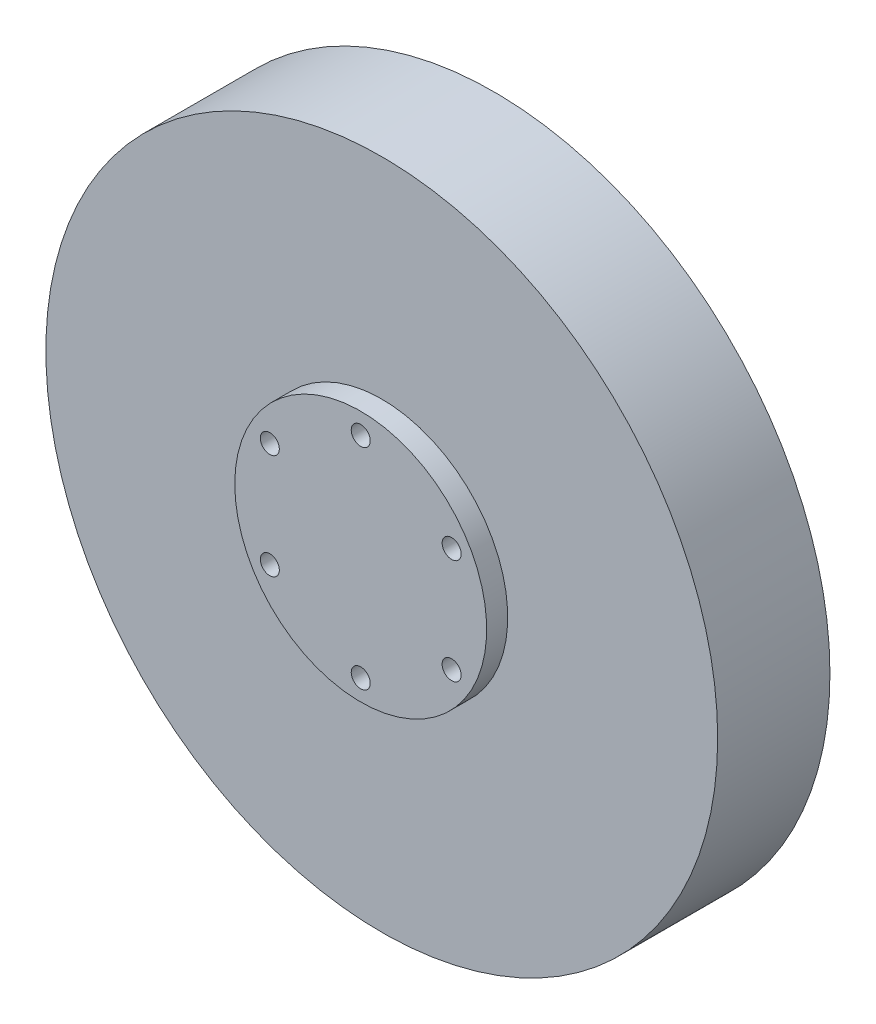
ISO-10303-21;
HEADER;
FILE_DESCRIPTION(('STEP AP214'),'2;1');
FILE_NAME('part.step','',(''),(''),'','','');
FILE_SCHEMA(('AUTOMOTIVE_DESIGN { 1 0 10303 214 1 1 1 1 }'));
ENDSEC;
DATA;
#1=APPLICATION_CONTEXT('core data for automotive mechanical design processes');
#2=APPLICATION_PROTOCOL_DEFINITION('international standard','automotive_design',2000,#1);
#3=PRODUCT_CONTEXT('',#1,'mechanical');
#4=PRODUCT('Part','Part','',(#3));
#5=PRODUCT_RELATED_PRODUCT_CATEGORY('part','',(#4));
#6=PRODUCT_DEFINITION_FORMATION('','',#4);
#7=PRODUCT_DEFINITION_CONTEXT('part definition',#1,'design');
#8=PRODUCT_DEFINITION('design','',#6,#7);
#9=PRODUCT_DEFINITION_SHAPE('','',#8);
#10=(LENGTH_UNIT() NAMED_UNIT(*) SI_UNIT(.MILLI.,.METRE.));
#11=(NAMED_UNIT(*) PLANE_ANGLE_UNIT() SI_UNIT($,.RADIAN.));
#12=(NAMED_UNIT(*) SI_UNIT($,.STERADIAN.) SOLID_ANGLE_UNIT());
#13=UNCERTAINTY_MEASURE_WITH_UNIT(LENGTH_MEASURE(1.E-05),#10,'distance_accuracy_value','');
#14=(GEOMETRIC_REPRESENTATION_CONTEXT(3) GLOBAL_UNCERTAINTY_ASSIGNED_CONTEXT((#13)) GLOBAL_UNIT_ASSIGNED_CONTEXT((#10,
#11,#12)) REPRESENTATION_CONTEXT('',''));
#15=CARTESIAN_POINT('',(0.,0.,0.));
#16=DIRECTION('',(0.,0.,1.));
#17=DIRECTION('',(1.,0.,0.));
#18=AXIS2_PLACEMENT_3D('',#15,#16,#17);
#19=CARTESIAN_POINT('',(0.,0.,30.16));
#20=DIRECTION('',(0.,0.,1.));
#21=DIRECTION('',(1.,0.,0.));
#22=AXIS2_PLACEMENT_3D('',#19,#20,#21);
#23=PLANE('',#22);
#24=CARTESIAN_POINT('',(0.,23.75,30.16));
#25=DIRECTION('',(0.,0.,-1.));
#26=DIRECTION('',(-1.,0.,0.));
#27=AXIS2_PLACEMENT_3D('',#24,#25,#26);
#28=CIRCLE('',#27,2.15);
#29=CARTESIAN_POINT('',(-2.15,23.75,30.16));
#30=VERTEX_POINT('',#29);
#31=EDGE_CURVE('E68',#30,#30,#28,.T.);
#32=ORIENTED_EDGE('',*,*,#31,.T.);
#33=EDGE_LOOP('',(#32));
#34=FACE_BOUND('',#33,.T.);
#35=CARTESIAN_POINT('',(-20.5681033398804,-11.875,30.16));
#36=DIRECTION('',(0.,0.,-1.));
#37=DIRECTION('',(-1.,0.,0.));
#38=AXIS2_PLACEMENT_3D('',#35,#36,#37);
#39=CIRCLE('',#38,2.15);
#40=CARTESIAN_POINT('',(-22.7181033398804,-11.875,30.16));
#41=VERTEX_POINT('',#40);
#42=EDGE_CURVE('E72',#41,#41,#39,.T.);
#43=ORIENTED_EDGE('',*,*,#42,.T.);
#44=EDGE_LOOP('',(#43));
#45=FACE_BOUND('',#44,.T.);
#46=CARTESIAN_POINT('',(20.5681033398804,-11.875,30.16));
#47=DIRECTION('',(0.,0.,-1.));
#48=DIRECTION('',(-1.,0.,0.));
#49=AXIS2_PLACEMENT_3D('',#46,#47,#48);
#50=CIRCLE('',#49,2.15);
#51=CARTESIAN_POINT('',(18.4181033398804,-11.875,30.16));
#52=VERTEX_POINT('',#51);
#53=EDGE_CURVE('E76',#52,#52,#50,.T.);
#54=ORIENTED_EDGE('',*,*,#53,.T.);
#55=EDGE_LOOP('',(#54));
#56=FACE_BOUND('',#55,.T.);
#57=CARTESIAN_POINT('',(20.5681033398804,11.875,30.16));
#58=DIRECTION('',(0.,0.,-1.));
#59=DIRECTION('',(-1.,0.,0.));
#60=AXIS2_PLACEMENT_3D('',#57,#58,#59);
#61=CIRCLE('',#60,2.15);
#62=CARTESIAN_POINT('',(18.4181033398804,11.875,30.16));
#63=VERTEX_POINT('',#62);
#64=EDGE_CURVE('E80',#63,#63,#61,.T.);
#65=ORIENTED_EDGE('',*,*,#64,.T.);
#66=EDGE_LOOP('',(#65));
#67=FACE_BOUND('',#66,.T.);
#68=CARTESIAN_POINT('',(0.,-23.75,30.16));
#69=DIRECTION('',(0.,0.,-1.));
#70=DIRECTION('',(-1.,0.,0.));
#71=AXIS2_PLACEMENT_3D('',#68,#69,#70);
#72=CIRCLE('',#71,2.15);
#73=CARTESIAN_POINT('',(-2.15,-23.75,30.16));
#74=VERTEX_POINT('',#73);
#75=EDGE_CURVE('E84',#74,#74,#72,.T.);
#76=ORIENTED_EDGE('',*,*,#75,.T.);
#77=EDGE_LOOP('',(#76));
#78=FACE_BOUND('',#77,.T.);
#79=CARTESIAN_POINT('',(-20.5681033398804,11.875,30.16));
#80=DIRECTION('',(0.,0.,-1.));
#81=DIRECTION('',(-1.,0.,0.));
#82=AXIS2_PLACEMENT_3D('',#79,#80,#81);
#83=CIRCLE('',#82,2.15);
#84=CARTESIAN_POINT('',(-22.7181033398804,11.875,30.16));
#85=VERTEX_POINT('',#84);
#86=EDGE_CURVE('E87',#85,#85,#83,.T.);
#87=ORIENTED_EDGE('',*,*,#86,.T.);
#88=EDGE_LOOP('',(#87));
#89=FACE_BOUND('',#88,.T.);
#90=CARTESIAN_POINT('',(0.,0.,30.16));
#91=DIRECTION('',(0.,0.,-1.));
#92=DIRECTION('',(-1.,0.,0.));
#93=AXIS2_PLACEMENT_3D('',#90,#91,#92);
#94=CIRCLE('',#93,28.5);
#95=CARTESIAN_POINT('',(-28.5,0.,30.16));
#96=VERTEX_POINT('',#95);
#97=EDGE_CURVE('E18',#96,#96,#94,.T.);
#98=ORIENTED_EDGE('',*,*,#97,.F.);
#99=EDGE_LOOP('',(#98));
#100=FACE_BOUND('',#99,.T.);
#101=ADVANCED_FACE('F15',(#34,#45,#56,#67,#78,#89,#100),#23,.T.);
#102=CARTESIAN_POINT('',(0.,0.,0.));
#103=DIRECTION('',(0.,0.,-1.));
#104=DIRECTION('',(-1.,0.,0.));
#105=AXIS2_PLACEMENT_3D('',#102,#103,#104);
#106=CYLINDRICAL_SURFACE('',#105,28.5);
#107=ORIENTED_EDGE('',*,*,#97,.T.);
#108=EDGE_LOOP('',(#107));
#109=FACE_BOUND('',#108,.T.);
#110=CARTESIAN_POINT('',(0.,0.,25.4));
#111=DIRECTION('',(0.,0.,-1.));
#112=DIRECTION('',(-1.,0.,0.));
#113=AXIS2_PLACEMENT_3D('',#110,#111,#112);
#114=CIRCLE('',#113,28.5);
#115=CARTESIAN_POINT('',(-28.5,0.,25.4));
#116=VERTEX_POINT('',#115);
#117=EDGE_CURVE('E64',#116,#116,#114,.T.);
#118=ORIENTED_EDGE('',*,*,#117,.F.);
#119=EDGE_LOOP('',(#118));
#120=FACE_BOUND('',#119,.T.);
#121=ADVANCED_FACE('F96',(#109,#120),#106,.T.);
#122=CARTESIAN_POINT('',(-20.5681033398804,11.875,0.));
#123=DIRECTION('',(0.,0.,-1.));
#124=DIRECTION('',(-1.,0.,0.));
#125=AXIS2_PLACEMENT_3D('',#122,#123,#124);
#126=CYLINDRICAL_SURFACE('',#125,2.15);
#127=ORIENTED_EDGE('',*,*,#86,.F.);
#128=EDGE_LOOP('',(#127));
#129=FACE_BOUND('',#128,.T.);
#130=CARTESIAN_POINT('',(-20.5681033398804,11.875,-4.76));
#131=DIRECTION('',(0.,0.,-1.));
#132=DIRECTION('',(-1.,0.,0.));
#133=AXIS2_PLACEMENT_3D('',#130,#131,#132);
#134=CIRCLE('',#133,2.15);
#135=CARTESIAN_POINT('',(-22.7181033398804,11.875,-4.76));
#136=VERTEX_POINT('',#135);
#137=EDGE_CURVE('E60',#136,#136,#134,.T.);
#138=ORIENTED_EDGE('',*,*,#137,.T.);
#139=EDGE_LOOP('',(#138));
#140=FACE_BOUND('',#139,.T.);
#141=ADVANCED_FACE('F105',(#129,#140),#126,.F.);
#142=CARTESIAN_POINT('',(0.,-23.75,0.));
#143=DIRECTION('',(0.,0.,-1.));
#144=DIRECTION('',(-1.,0.,0.));
#145=AXIS2_PLACEMENT_3D('',#142,#143,#144);
#146=CYLINDRICAL_SURFACE('',#145,2.15);
#147=ORIENTED_EDGE('',*,*,#75,.F.);
#148=EDGE_LOOP('',(#147));
#149=FACE_BOUND('',#148,.T.);
#150=CARTESIAN_POINT('',(0.,-23.75,-4.76));
#151=DIRECTION('',(0.,0.,-1.));
#152=DIRECTION('',(-1.,0.,0.));
#153=AXIS2_PLACEMENT_3D('',#150,#151,#152);
#154=CIRCLE('',#153,2.15);
#155=CARTESIAN_POINT('',(-2.15,-23.75,-4.76));
#156=VERTEX_POINT('',#155);
#157=EDGE_CURVE('E56',#156,#156,#154,.T.);
#158=ORIENTED_EDGE('',*,*,#157,.T.);
#159=EDGE_LOOP('',(#158));
#160=FACE_BOUND('',#159,.T.);
#161=ADVANCED_FACE('F145',(#149,#160),#146,.F.);
#162=CARTESIAN_POINT('',(20.5681033398804,11.875,0.));
#163=DIRECTION('',(0.,0.,-1.));
#164=DIRECTION('',(-1.,0.,0.));
#165=AXIS2_PLACEMENT_3D('',#162,#163,#164);
#166=CYLINDRICAL_SURFACE('',#165,2.15);
#167=ORIENTED_EDGE('',*,*,#64,.F.);
#168=EDGE_LOOP('',(#167));
#169=FACE_BOUND('',#168,.T.);
#170=CARTESIAN_POINT('',(20.5681033398804,11.875,-4.76));
#171=DIRECTION('',(0.,0.,-1.));
#172=DIRECTION('',(-1.,0.,0.));
#173=AXIS2_PLACEMENT_3D('',#170,#171,#172);
#174=CIRCLE('',#173,2.15);
#175=CARTESIAN_POINT('',(18.4181033398804,11.875,-4.76));
#176=VERTEX_POINT('',#175);
#177=EDGE_CURVE('E52',#176,#176,#174,.T.);
#178=ORIENTED_EDGE('',*,*,#177,.T.);
#179=EDGE_LOOP('',(#178));
#180=FACE_BOUND('',#179,.T.);
#181=ADVANCED_FACE('F141',(#169,#180),#166,.F.);
#182=CARTESIAN_POINT('',(20.5681033398804,-11.875,0.));
#183=DIRECTION('',(0.,0.,-1.));
#184=DIRECTION('',(-1.,0.,0.));
#185=AXIS2_PLACEMENT_3D('',#182,#183,#184);
#186=CYLINDRICAL_SURFACE('',#185,2.15);
#187=ORIENTED_EDGE('',*,*,#53,.F.);
#188=EDGE_LOOP('',(#187));
#189=FACE_BOUND('',#188,.T.);
#190=CARTESIAN_POINT('',(20.5681033398804,-11.875,-4.76));
#191=DIRECTION('',(0.,0.,-1.));
#192=DIRECTION('',(-1.,0.,0.));
#193=AXIS2_PLACEMENT_3D('',#190,#191,#192);
#194=CIRCLE('',#193,2.15);
#195=CARTESIAN_POINT('',(18.4181033398804,-11.875,-4.76));
#196=VERTEX_POINT('',#195);
#197=EDGE_CURVE('E48',#196,#196,#194,.T.);
#198=ORIENTED_EDGE('',*,*,#197,.T.);
#199=EDGE_LOOP('',(#198));
#200=FACE_BOUND('',#199,.T.);
#201=ADVANCED_FACE('F137',(#189,#200),#186,.F.);
#202=CARTESIAN_POINT('',(-20.5681033398804,-11.875,0.));
#203=DIRECTION('',(0.,0.,-1.));
#204=DIRECTION('',(-1.,0.,0.));
#205=AXIS2_PLACEMENT_3D('',#202,#203,#204);
#206=CYLINDRICAL_SURFACE('',#205,2.15);
#207=ORIENTED_EDGE('',*,*,#42,.F.);
#208=EDGE_LOOP('',(#207));
#209=FACE_BOUND('',#208,.T.);
#210=CARTESIAN_POINT('',(-20.5681033398804,-11.875,-4.76));
#211=DIRECTION('',(0.,0.,-1.));
#212=DIRECTION('',(-1.,0.,0.));
#213=AXIS2_PLACEMENT_3D('',#210,#211,#212);
#214=CIRCLE('',#213,2.15);
#215=CARTESIAN_POINT('',(-22.7181033398804,-11.875,-4.76));
#216=VERTEX_POINT('',#215);
#217=EDGE_CURVE('E44',#216,#216,#214,.T.);
#218=ORIENTED_EDGE('',*,*,#217,.T.);
#219=EDGE_LOOP('',(#218));
#220=FACE_BOUND('',#219,.T.);
#221=ADVANCED_FACE('F133',(#209,#220),#206,.F.);
#222=CARTESIAN_POINT('',(0.,23.75,0.));
#223=DIRECTION('',(0.,0.,-1.));
#224=DIRECTION('',(-1.,0.,0.));
#225=AXIS2_PLACEMENT_3D('',#222,#223,#224);
#226=CYLINDRICAL_SURFACE('',#225,2.15);
#227=ORIENTED_EDGE('',*,*,#31,.F.);
#228=EDGE_LOOP('',(#227));
#229=FACE_BOUND('',#228,.T.);
#230=CARTESIAN_POINT('',(0.,23.75,-4.76));
#231=DIRECTION('',(0.,0.,-1.));
#232=DIRECTION('',(-1.,0.,0.));
#233=AXIS2_PLACEMENT_3D('',#230,#231,#232);
#234=CIRCLE('',#233,2.15);
#235=CARTESIAN_POINT('',(-2.15,23.75,-4.76));
#236=VERTEX_POINT('',#235);
#237=EDGE_CURVE('E40',#236,#236,#234,.T.);
#238=ORIENTED_EDGE('',*,*,#237,.T.);
#239=EDGE_LOOP('',(#238));
#240=FACE_BOUND('',#239,.T.);
#241=ADVANCED_FACE('F129',(#229,#240),#226,.F.);
#242=CARTESIAN_POINT('',(0.,0.,25.4));
#243=DIRECTION('',(0.,0.,1.));
#244=DIRECTION('',(1.,0.,0.));
#245=AXIS2_PLACEMENT_3D('',#242,#243,#244);
#246=PLANE('',#245);
#247=ORIENTED_EDGE('',*,*,#117,.T.);
#248=EDGE_LOOP('',(#247));
#249=FACE_BOUND('',#248,.T.);
#250=CARTESIAN_POINT('',(0.,0.,25.4));
#251=DIRECTION('',(0.,0.,1.));
#252=DIRECTION('',(1.,0.,0.));
#253=AXIS2_PLACEMENT_3D('',#250,#251,#252);
#254=CIRCLE('',#253,76.);
#255=CARTESIAN_POINT('',(76.,0.,25.4));
#256=VERTEX_POINT('',#255);
#257=EDGE_CURVE('E36',#256,#256,#254,.F.);
#258=ORIENTED_EDGE('',*,*,#257,.F.);
#259=EDGE_LOOP('',(#258));
#260=FACE_BOUND('',#259,.T.);
#261=ADVANCED_FACE('F125',(#249,#260),#246,.T.);
#262=CARTESIAN_POINT('',(0.,0.,-4.76));
#263=DIRECTION('',(0.,0.,1.));
#264=DIRECTION('',(1.,0.,0.));
#265=AXIS2_PLACEMENT_3D('',#262,#263,#264);
#266=PLANE('',#265);
#267=ORIENTED_EDGE('',*,*,#237,.F.);
#268=EDGE_LOOP('',(#267));
#269=FACE_BOUND('',#268,.T.);
#270=ORIENTED_EDGE('',*,*,#217,.F.);
#271=EDGE_LOOP('',(#270));
#272=FACE_BOUND('',#271,.T.);
#273=ORIENTED_EDGE('',*,*,#197,.F.);
#274=EDGE_LOOP('',(#273));
#275=FACE_BOUND('',#274,.T.);
#276=ORIENTED_EDGE('',*,*,#177,.F.);
#277=EDGE_LOOP('',(#276));
#278=FACE_BOUND('',#277,.T.);
#279=ORIENTED_EDGE('',*,*,#157,.F.);
#280=EDGE_LOOP('',(#279));
#281=FACE_BOUND('',#280,.T.);
#282=ORIENTED_EDGE('',*,*,#137,.F.);
#283=EDGE_LOOP('',(#282));
#284=FACE_BOUND('',#283,.T.);
#285=CARTESIAN_POINT('',(0.,0.,-4.76));
#286=DIRECTION('',(0.,0.,-1.));
#287=DIRECTION('',(-1.,0.,0.));
#288=AXIS2_PLACEMENT_3D('',#285,#286,#287);
#289=CIRCLE('',#288,28.5);
#290=CARTESIAN_POINT('',(-28.5,0.,-4.76));
#291=VERTEX_POINT('',#290);
#292=EDGE_CURVE('E30',#291,#291,#289,.F.);
#293=ORIENTED_EDGE('',*,*,#292,.F.);
#294=EDGE_LOOP('',(#293));
#295=FACE_BOUND('',#294,.T.);
#296=ADVANCED_FACE('F121',(#269,#272,#275,#278,#281,#284,#295),#266,.F.);
#297=CARTESIAN_POINT('',(0.,0.,0.));
#298=DIRECTION('',(0.,0.,1.));
#299=DIRECTION('',(1.,0.,0.));
#300=AXIS2_PLACEMENT_3D('',#297,#298,#299);
#301=CYLINDRICAL_SURFACE('',#300,76.);
#302=CARTESIAN_POINT('',(0.,0.,0.));
#303=DIRECTION('',(0.,0.,1.));
#304=DIRECTION('',(1.,0.,0.));
#305=AXIS2_PLACEMENT_3D('',#302,#303,#304);
#306=CIRCLE('',#305,76.);
#307=CARTESIAN_POINT('',(76.,0.,0.));
#308=VERTEX_POINT('',#307);
#309=EDGE_CURVE('E23',#308,#308,#306,.T.);
#310=ORIENTED_EDGE('',*,*,#309,.T.);
#311=EDGE_LOOP('',(#310));
#312=FACE_BOUND('',#311,.T.);
#313=ORIENTED_EDGE('',*,*,#257,.T.);
#314=EDGE_LOOP('',(#313));
#315=FACE_BOUND('',#314,.T.);
#316=ADVANCED_FACE('F115',(#312,#315),#301,.T.);
#317=CARTESIAN_POINT('',(0.,0.,0.));
#318=DIRECTION('',(0.,0.,-1.));
#319=DIRECTION('',(-1.,0.,0.));
#320=AXIS2_PLACEMENT_3D('',#317,#318,#319);
#321=CYLINDRICAL_SURFACE('',#320,28.5);
#322=CARTESIAN_POINT('',(0.,0.,0.));
#323=DIRECTION('',(0.,0.,-1.));
#324=DIRECTION('',(-1.,0.,0.));
#325=AXIS2_PLACEMENT_3D('',#322,#323,#324);
#326=CIRCLE('',#325,28.5);
#327=CARTESIAN_POINT('',(-28.5,0.,0.));
#328=VERTEX_POINT('',#327);
#329=EDGE_CURVE('E10',#328,#328,#326,.T.);
#330=ORIENTED_EDGE('',*,*,#329,.T.);
#331=EDGE_LOOP('',(#330));
#332=FACE_BOUND('',#331,.T.);
#333=ORIENTED_EDGE('',*,*,#292,.T.);
#334=EDGE_LOOP('',(#333));
#335=FACE_BOUND('',#334,.T.);
#336=ADVANCED_FACE('F109',(#332,#335),#321,.T.);
#337=CARTESIAN_POINT('',(0.,0.,0.));
#338=DIRECTION('',(0.,0.,1.));
#339=DIRECTION('',(1.,0.,0.));
#340=AXIS2_PLACEMENT_3D('',#337,#338,#339);
#341=PLANE('',#340);
#342=ORIENTED_EDGE('',*,*,#329,.F.);
#343=EDGE_LOOP('',(#342));
#344=FACE_BOUND('',#343,.T.);
#345=ORIENTED_EDGE('',*,*,#309,.F.);
#346=EDGE_LOOP('',(#345));
#347=FACE_BOUND('',#346,.T.);
#348=ADVANCED_FACE('F107',(#344,#347),#341,.F.);
#349=CLOSED_SHELL('',(#101,#121,#141,#161,#181,#201,#221,#241,#261,#296,#316,#336,#348));
#350=MANIFOLD_SOLID_BREP('B1',#349);
#351=ADVANCED_BREP_SHAPE_REPRESENTATION('',(#18,#350),#14);
#352=SHAPE_DEFINITION_REPRESENTATION(#9,#351);
ENDSEC;
END-ISO-10303-21;
